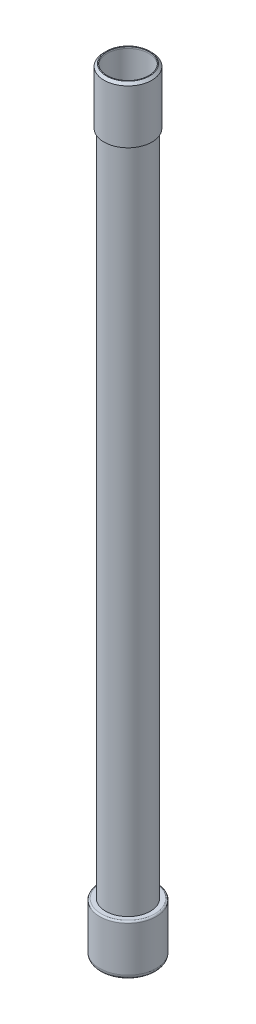
ISO-10303-21;
HEADER;
FILE_DESCRIPTION(('STEP AP214'),'2;1');
FILE_NAME('part.step','',(''),(''),'','','');
FILE_SCHEMA(('AUTOMOTIVE_DESIGN { 1 0 10303 214 1 1 1 1 }'));
ENDSEC;
DATA;
#1=APPLICATION_CONTEXT('core data for automotive mechanical design processes');
#2=APPLICATION_PROTOCOL_DEFINITION('international standard','automotive_design',2000,#1);
#3=PRODUCT_CONTEXT('',#1,'mechanical');
#4=PRODUCT('Part','Part','',(#3));
#5=PRODUCT_RELATED_PRODUCT_CATEGORY('part','',(#4));
#6=PRODUCT_DEFINITION_FORMATION('','',#4);
#7=PRODUCT_DEFINITION_CONTEXT('part definition',#1,'design');
#8=PRODUCT_DEFINITION('design','',#6,#7);
#9=PRODUCT_DEFINITION_SHAPE('','',#8);
#10=(LENGTH_UNIT() NAMED_UNIT(*) SI_UNIT(.MILLI.,.METRE.));
#11=(NAMED_UNIT(*) PLANE_ANGLE_UNIT() SI_UNIT($,.RADIAN.));
#12=(NAMED_UNIT(*) SI_UNIT($,.STERADIAN.) SOLID_ANGLE_UNIT());
#13=UNCERTAINTY_MEASURE_WITH_UNIT(LENGTH_MEASURE(1.E-05),#10,'distance_accuracy_value','');
#14=(GEOMETRIC_REPRESENTATION_CONTEXT(3) GLOBAL_UNCERTAINTY_ASSIGNED_CONTEXT((#13)) GLOBAL_UNIT_ASSIGNED_CONTEXT((#10,
#11,#12)) REPRESENTATION_CONTEXT('',''));
#15=CARTESIAN_POINT('',(0.,0.,0.));
#16=DIRECTION('',(0.,0.,1.));
#17=DIRECTION('',(1.,0.,0.));
#18=AXIS2_PLACEMENT_3D('',#15,#16,#17);
#19=CARTESIAN_POINT('',(13.,241.,0.));
#20=DIRECTION('',(0.,-1.,0.));
#21=DIRECTION('',(0.,0.,-1.));
#22=AXIS2_PLACEMENT_3D('',#19,#20,#21);
#23=PLANE('',#22);
#24=CARTESIAN_POINT('',(0.,241.,0.));
#25=DIRECTION('',(0.,-1.,0.));
#26=DIRECTION('',(0.,0.,-1.));
#27=AXIS2_PLACEMENT_3D('',#24,#25,#26);
#28=CIRCLE('',#27,13.5);
#29=CARTESIAN_POINT('',(0.,241.,-13.5));
#30=VERTEX_POINT('',#29);
#31=EDGE_CURVE('E50',#30,#30,#28,.F.);
#32=ORIENTED_EDGE('',*,*,#31,.T.);
#33=EDGE_LOOP('',(#32));
#34=FACE_BOUND('',#33,.T.);
#35=CARTESIAN_POINT('',(0.,241.,0.));
#36=DIRECTION('',(0.,1.,0.));
#37=DIRECTION('',(0.,0.,1.));
#38=AXIS2_PLACEMENT_3D('',#35,#36,#37);
#39=CIRCLE('',#38,13.);
#40=CARTESIAN_POINT('',(0.,241.,13.));
#41=VERTEX_POINT('',#40);
#42=EDGE_CURVE('E69',#41,#41,#39,.T.);
#43=ORIENTED_EDGE('',*,*,#42,.F.);
#44=EDGE_LOOP('',(#43));
#45=FACE_BOUND('',#44,.T.);
#46=ADVANCED_FACE('F43',(#34,#45),#23,.F.);
#47=CARTESIAN_POINT('',(0.,250.648791431477,0.));
#48=DIRECTION('',(0.,1.,0.));
#49=DIRECTION('',(0.,0.,1.));
#50=AXIS2_PLACEMENT_3D('',#47,#48,#49);
#51=CYLINDRICAL_SURFACE('',#50,15.);
#52=CARTESIAN_POINT('',(0.,239.5,0.));
#53=DIRECTION('',(0.,-1.,0.));
#54=DIRECTION('',(0.,0.,-1.));
#55=AXIS2_PLACEMENT_3D('',#52,#53,#54);
#56=CIRCLE('',#55,15.);
#57=CARTESIAN_POINT('',(0.,239.5,-15.));
#58=VERTEX_POINT('',#57);
#59=EDGE_CURVE('E11',#58,#58,#56,.T.);
#60=ORIENTED_EDGE('',*,*,#59,.T.);
#61=EDGE_LOOP('',(#60));
#62=FACE_BOUND('',#61,.T.);
#63=CARTESIAN_POINT('',(0.,206.,0.));
#64=DIRECTION('',(0.,1.,0.));
#65=DIRECTION('',(0.,0.,1.));
#66=AXIS2_PLACEMENT_3D('',#63,#64,#65);
#67=CIRCLE('',#66,15.);
#68=CARTESIAN_POINT('',(0.,206.,15.));
#69=VERTEX_POINT('',#68);
#70=EDGE_CURVE('E54',#69,#69,#67,.T.);
#71=ORIENTED_EDGE('',*,*,#70,.T.);
#72=EDGE_LOOP('',(#71));
#73=FACE_BOUND('',#72,.T.);
#74=ADVANCED_FACE('F76',(#62,#73),#51,.T.);
#75=CARTESIAN_POINT('',(15.,206.,0.));
#76=DIRECTION('',(0.,1.,0.));
#77=DIRECTION('',(0.,0.,1.));
#78=AXIS2_PLACEMENT_3D('',#75,#76,#77);
#79=PLANE('',#78);
#80=ORIENTED_EDGE('',*,*,#70,.F.);
#81=EDGE_LOOP('',(#80));
#82=FACE_BOUND('',#81,.T.);
#83=CARTESIAN_POINT('',(0.,206.,0.));
#84=DIRECTION('',(0.,1.,0.));
#85=DIRECTION('',(0.,0.,1.));
#86=AXIS2_PLACEMENT_3D('',#83,#84,#85);
#87=CIRCLE('',#86,14.);
#88=CARTESIAN_POINT('',(0.,206.,14.));
#89=VERTEX_POINT('',#88);
#90=EDGE_CURVE('E58',#89,#89,#87,.T.);
#91=ORIENTED_EDGE('',*,*,#90,.T.);
#92=EDGE_LOOP('',(#91));
#93=FACE_BOUND('',#92,.T.);
#94=ADVANCED_FACE('F80',(#82,#93),#79,.F.);
#95=CARTESIAN_POINT('',(0.,250.648791431477,0.));
#96=DIRECTION('',(0.,1.,0.));
#97=DIRECTION('',(0.,0.,1.));
#98=AXIS2_PLACEMENT_3D('',#95,#96,#97);
#99=CYLINDRICAL_SURFACE('',#98,14.);
#100=ORIENTED_EDGE('',*,*,#90,.F.);
#101=EDGE_LOOP('',(#100));
#102=FACE_BOUND('',#101,.T.);
#103=CARTESIAN_POINT('',(0.,240.,0.));
#104=DIRECTION('',(0.,1.,0.));
#105=DIRECTION('',(0.,0.,1.));
#106=AXIS2_PLACEMENT_3D('',#103,#104,#105);
#107=CIRCLE('',#106,14.);
#108=CARTESIAN_POINT('',(0.,240.,14.));
#109=VERTEX_POINT('',#108);
#110=EDGE_CURVE('E63',#109,#109,#107,.T.);
#111=ORIENTED_EDGE('',*,*,#110,.T.);
#112=EDGE_LOOP('',(#111));
#113=FACE_BOUND('',#112,.T.);
#114=ADVANCED_FACE('F85',(#102,#113),#99,.F.);
#115=CARTESIAN_POINT('',(14.,240.,0.));
#116=DIRECTION('',(0.,1.,0.));
#117=DIRECTION('',(0.,0.,1.));
#118=AXIS2_PLACEMENT_3D('',#115,#116,#117);
#119=PLANE('',#118);
#120=ORIENTED_EDGE('',*,*,#110,.F.);
#121=EDGE_LOOP('',(#120));
#122=FACE_BOUND('',#121,.T.);
#123=CARTESIAN_POINT('',(0.,240.,0.));
#124=DIRECTION('',(0.,1.,0.));
#125=DIRECTION('',(0.,0.,1.));
#126=AXIS2_PLACEMENT_3D('',#123,#124,#125);
#127=CIRCLE('',#126,13.);
#128=CARTESIAN_POINT('',(0.,240.,13.));
#129=VERTEX_POINT('',#128);
#130=EDGE_CURVE('E66',#129,#129,#127,.T.);
#131=ORIENTED_EDGE('',*,*,#130,.T.);
#132=EDGE_LOOP('',(#131));
#133=FACE_BOUND('',#132,.T.);
#134=ADVANCED_FACE('F89',(#122,#133),#119,.F.);
#135=CARTESIAN_POINT('',(0.,250.648791431477,0.));
#136=DIRECTION('',(0.,1.,0.));
#137=DIRECTION('',(0.,0.,1.));
#138=AXIS2_PLACEMENT_3D('',#135,#136,#137);
#139=CYLINDRICAL_SURFACE('',#138,13.);
#140=ORIENTED_EDGE('',*,*,#130,.F.);
#141=EDGE_LOOP('',(#140));
#142=FACE_BOUND('',#141,.T.);
#143=ORIENTED_EDGE('',*,*,#42,.T.);
#144=EDGE_LOOP('',(#143));
#145=FACE_BOUND('',#144,.T.);
#146=ADVANCED_FACE('F73',(#142,#145),#139,.F.);
#147=CARTESIAN_POINT('',(0.,241.,0.));
#148=DIRECTION('',(0.,-1.,0.));
#149=DIRECTION('',(0.,0.,-1.));
#150=AXIS2_PLACEMENT_3D('',#147,#148,#149);
#151=CONICAL_SURFACE('',#150,13.5,0.785398163397452);
#152=ORIENTED_EDGE('',*,*,#59,.F.);
#153=EDGE_LOOP('',(#152));
#154=FACE_BOUND('',#153,.T.);
#155=ORIENTED_EDGE('',*,*,#31,.F.);
#156=EDGE_LOOP('',(#155));
#157=FACE_BOUND('',#156,.T.);
#158=ADVANCED_FACE('F45',(#154,#157),#151,.T.);
#159=CLOSED_SHELL('',(#46,#74,#94,#114,#134,#146,#158));
#160=MANIFOLD_SOLID_BREP('B2',#159);
#161=CARTESIAN_POINT('',(0.,-191.854456481253,0.));
#162=DIRECTION('',(0.,1.,0.));
#163=DIRECTION('',(0.,0.,1.));
#164=AXIS2_PLACEMENT_3D('',#161,#162,#163);
#165=CYLINDRICAL_SURFACE('',#164,17.75);
#166=CARTESIAN_POINT('',(0.,-212.,0.));
#167=DIRECTION('',(0.,-1.,0.));
#168=DIRECTION('',(0.,0.,-1.));
#169=AXIS2_PLACEMENT_3D('',#166,#167,#168);
#170=CIRCLE('',#169,17.75);
#171=CARTESIAN_POINT('',(0.,-212.,-17.75));
#172=VERTEX_POINT('',#171);
#173=EDGE_CURVE('E42',#172,#172,#170,.T.);
#174=ORIENTED_EDGE('',*,*,#173,.T.);
#175=EDGE_LOOP('',(#174));
#176=FACE_BOUND('',#175,.T.);
#177=CARTESIAN_POINT('',(0.,-240.052731737533,0.));
#178=DIRECTION('',(0.,1.,0.));
#179=DIRECTION('',(0.,0.,1.));
#180=AXIS2_PLACEMENT_3D('',#177,#178,#179);
#181=CIRCLE('',#180,17.75);
#182=CARTESIAN_POINT('',(0.,-240.052731737533,17.75));
#183=VERTEX_POINT('',#182);
#184=EDGE_CURVE('E171',#183,#183,#181,.T.);
#185=ORIENTED_EDGE('',*,*,#184,.T.);
#186=EDGE_LOOP('',(#185));
#187=FACE_BOUND('',#186,.T.);
#188=ADVANCED_FACE('F156',(#176,#187),#165,.T.);
#189=CARTESIAN_POINT('',(13.,-211.,0.));
#190=DIRECTION('',(0.,-1.,0.));
#191=DIRECTION('',(0.,0.,-1.));
#192=AXIS2_PLACEMENT_3D('',#189,#190,#191);
#193=PLANE('',#192);
#194=CARTESIAN_POINT('',(0.,-211.,0.));
#195=DIRECTION('',(0.,-1.,0.));
#196=DIRECTION('',(0.,0.,-1.));
#197=AXIS2_PLACEMENT_3D('',#194,#195,#196);
#198=CIRCLE('',#197,16.75);
#199=CARTESIAN_POINT('',(0.,-211.,-16.75));
#200=VERTEX_POINT('',#199);
#201=EDGE_CURVE('E163',#200,#200,#198,.F.);
#202=ORIENTED_EDGE('',*,*,#201,.T.);
#203=EDGE_LOOP('',(#202));
#204=FACE_BOUND('',#203,.T.);
#205=CARTESIAN_POINT('',(0.,-211.,0.));
#206=DIRECTION('',(0.,1.,0.));
#207=DIRECTION('',(0.,0.,1.));
#208=AXIS2_PLACEMENT_3D('',#205,#206,#207);
#209=CIRCLE('',#208,13.);
#210=CARTESIAN_POINT('',(0.,-211.,13.));
#211=VERTEX_POINT('',#210);
#212=EDGE_CURVE('E176',#211,#211,#209,.T.);
#213=ORIENTED_EDGE('',*,*,#212,.F.);
#214=EDGE_LOOP('',(#213));
#215=FACE_BOUND('',#214,.T.);
#216=ADVANCED_FACE('F188',(#204,#215),#193,.F.);
#217=CARTESIAN_POINT('',(0.,-191.854456481253,0.));
#218=DIRECTION('',(0.,1.,0.));
#219=DIRECTION('',(0.,0.,1.));
#220=AXIS2_PLACEMENT_3D('',#217,#218,#219);
#221=CYLINDRICAL_SURFACE('',#220,13.);
#222=CARTESIAN_POINT('',(0.,-240.,0.));
#223=DIRECTION('',(0.,1.,0.));
#224=DIRECTION('',(0.,0.,1.));
#225=AXIS2_PLACEMENT_3D('',#222,#223,#224);
#226=CIRCLE('',#225,13.);
#227=CARTESIAN_POINT('',(0.,-240.,13.));
#228=VERTEX_POINT('',#227);
#229=EDGE_CURVE('E179',#228,#228,#226,.T.);
#230=ORIENTED_EDGE('',*,*,#229,.F.);
#231=EDGE_LOOP('',(#230));
#232=FACE_BOUND('',#231,.T.);
#233=ORIENTED_EDGE('',*,*,#212,.T.);
#234=EDGE_LOOP('',(#233));
#235=FACE_BOUND('',#234,.T.);
#236=ADVANCED_FACE('F185',(#232,#235),#221,.F.);
#237=CARTESIAN_POINT('',(0.,-240.,0.));
#238=DIRECTION('',(0.,-1.,0.));
#239=DIRECTION('',(0.,0.,-1.));
#240=AXIS2_PLACEMENT_3D('',#237,#238,#239);
#241=PLANE('',#240);
#242=ORIENTED_EDGE('',*,*,#229,.T.);
#243=EDGE_LOOP('',(#242));
#244=FACE_BOUND('',#243,.T.);
#245=ADVANCED_FACE('F183',(#244),#241,.F.);
#246=CARTESIAN_POINT('',(0.,-204.6171875,0.));
#247=DIRECTION('',(0.,1.,0.));
#248=DIRECTION('',(1.,0.,0.));
#249=AXIS2_PLACEMENT_3D('',#246,#247,#248);
#250=SPHERICAL_SURFACE('',#249,41.3828125);
#251=CARTESIAN_POINT('',(0.,-242.82237329813,0.));
#252=DIRECTION('',(0.,1.,0.));
#253=DIRECTION('',(0.,0.,1.));
#254=AXIS2_PLACEMENT_3D('',#251,#252,#253);
#255=CIRCLE('',#254,15.9028597598209);
#256=CARTESIAN_POINT('',(0.,-242.82237329813,15.9028597598209));
#257=VERTEX_POINT('',#256);
#258=EDGE_CURVE('E167',#257,#257,#255,.F.);
#259=ORIENTED_EDGE('',*,*,#258,.T.);
#260=EDGE_LOOP('',(#259));
#261=FACE_BOUND('',#260,.T.);
#262=ADVANCED_FACE('F201',(#261),#250,.T.);
#263=CARTESIAN_POINT('',(0.,-240.052731737533,0.));
#264=DIRECTION('',(0.,1.,0.));
#265=DIRECTION('',(0.,0.,1.));
#266=AXIS2_PLACEMENT_3D('',#263,#264,#265);
#267=TOROIDAL_SURFACE('',#266,14.75,3.);
#268=ORIENTED_EDGE('',*,*,#258,.F.);
#269=EDGE_LOOP('',(#268));
#270=FACE_BOUND('',#269,.T.);
#271=ORIENTED_EDGE('',*,*,#184,.F.);
#272=EDGE_LOOP('',(#271));
#273=FACE_BOUND('',#272,.T.);
#274=ADVANCED_FACE('F199',(#270,#273),#267,.T.);
#275=CARTESIAN_POINT('',(0.,-212.,0.));
#276=DIRECTION('',(0.,-1.,0.));
#277=DIRECTION('',(0.,0.,-1.));
#278=AXIS2_PLACEMENT_3D('',#275,#276,#277);
#279=TOROIDAL_SURFACE('',#278,16.75,1.);
#280=ORIENTED_EDGE('',*,*,#173,.F.);
#281=EDGE_LOOP('',(#280));
#282=FACE_BOUND('',#281,.T.);
#283=ORIENTED_EDGE('',*,*,#201,.F.);
#284=EDGE_LOOP('',(#283));
#285=FACE_BOUND('',#284,.T.);
#286=ADVANCED_FACE('F158',(#282,#285),#279,.T.);
#287=CLOSED_SHELL('',(#188,#216,#236,#245,#262,#274,#286));
#288=MANIFOLD_SOLID_BREP('B6',#287);
#289=CARTESIAN_POINT('',(0.,240.,0.));
#290=DIRECTION('',(0.,1.,0.));
#291=DIRECTION('',(0.,0.,1.));
#292=AXIS2_PLACEMENT_3D('',#289,#290,#291);
#293=PLANE('',#292);
#294=CARTESIAN_POINT('',(0.,240.,0.));
#295=DIRECTION('',(0.,1.,0.));
#296=DIRECTION('',(0.,0.,1.));
#297=AXIS2_PLACEMENT_3D('',#294,#295,#296);
#298=CIRCLE('',#297,14.);
#299=CARTESIAN_POINT('',(0.,240.,14.));
#300=VERTEX_POINT('',#299);
#301=EDGE_CURVE('E155',#300,#300,#298,.T.);
#302=ORIENTED_EDGE('',*,*,#301,.T.);
#303=EDGE_LOOP('',(#302));
#304=FACE_BOUND('',#303,.T.);
#305=CARTESIAN_POINT('',(0.,240.,0.));
#306=DIRECTION('',(0.,1.,0.));
#307=DIRECTION('',(0.,0.,1.));
#308=AXIS2_PLACEMENT_3D('',#305,#306,#307);
#309=CIRCLE('',#308,13.);
#310=CARTESIAN_POINT('',(0.,240.,13.));
#311=VERTEX_POINT('',#310);
#312=EDGE_CURVE('E267',#311,#311,#309,.T.);
#313=ORIENTED_EDGE('',*,*,#312,.F.);
#314=EDGE_LOOP('',(#313));
#315=FACE_BOUND('',#314,.T.);
#316=ADVANCED_FACE('F256',(#304,#315),#293,.T.);
#317=CARTESIAN_POINT('',(0.,-240.,0.));
#318=DIRECTION('',(0.,1.,0.));
#319=DIRECTION('',(0.,0.,1.));
#320=AXIS2_PLACEMENT_3D('',#317,#318,#319);
#321=PLANE('',#320);
#322=CARTESIAN_POINT('',(0.,-240.,0.));
#323=DIRECTION('',(0.,1.,0.));
#324=DIRECTION('',(0.,0.,1.));
#325=AXIS2_PLACEMENT_3D('',#322,#323,#324);
#326=CIRCLE('',#325,14.);
#327=CARTESIAN_POINT('',(0.,-240.,14.));
#328=VERTEX_POINT('',#327);
#329=EDGE_CURVE('E260',#328,#328,#326,.T.);
#330=ORIENTED_EDGE('',*,*,#329,.F.);
#331=EDGE_LOOP('',(#330));
#332=FACE_BOUND('',#331,.T.);
#333=CARTESIAN_POINT('',(0.,-240.,0.));
#334=DIRECTION('',(0.,1.,0.));
#335=DIRECTION('',(0.,0.,1.));
#336=AXIS2_PLACEMENT_3D('',#333,#334,#335);
#337=CIRCLE('',#336,13.);
#338=CARTESIAN_POINT('',(0.,-240.,13.));
#339=VERTEX_POINT('',#338);
#340=EDGE_CURVE('E269',#339,#339,#337,.T.);
#341=ORIENTED_EDGE('',*,*,#340,.T.);
#342=EDGE_LOOP('',(#341));
#343=FACE_BOUND('',#342,.T.);
#344=ADVANCED_FACE('F279',(#332,#343),#321,.F.);
#345=CARTESIAN_POINT('',(0.,240.,0.));
#346=DIRECTION('',(0.,-1.,0.));
#347=DIRECTION('',(0.,0.,-1.));
#348=AXIS2_PLACEMENT_3D('',#345,#346,#347);
#349=CYLINDRICAL_SURFACE('',#348,14.);
#350=ORIENTED_EDGE('',*,*,#301,.F.);
#351=EDGE_LOOP('',(#350));
#352=FACE_BOUND('',#351,.T.);
#353=ORIENTED_EDGE('',*,*,#329,.T.);
#354=EDGE_LOOP('',(#353));
#355=FACE_BOUND('',#354,.T.);
#356=ADVANCED_FACE('F258',(#352,#355),#349,.T.);
#357=CARTESIAN_POINT('',(0.,240.,0.));
#358=DIRECTION('',(0.,-1.,0.));
#359=DIRECTION('',(0.,0.,-1.));
#360=AXIS2_PLACEMENT_3D('',#357,#358,#359);
#361=CYLINDRICAL_SURFACE('',#360,13.);
#362=ORIENTED_EDGE('',*,*,#312,.T.);
#363=EDGE_LOOP('',(#362));
#364=FACE_BOUND('',#363,.T.);
#365=ORIENTED_EDGE('',*,*,#340,.F.);
#366=EDGE_LOOP('',(#365));
#367=FACE_BOUND('',#366,.T.);
#368=ADVANCED_FACE('F275',(#364,#367),#361,.F.);
#369=CLOSED_SHELL('',(#316,#344,#356,#368));
#370=MANIFOLD_SOLID_BREP('B37',#369);
#371=ADVANCED_BREP_SHAPE_REPRESENTATION('',(#18,#160,#288,#370),#14);
#372=SHAPE_DEFINITION_REPRESENTATION(#9,#371);
ENDSEC;
END-ISO-10303-21;
